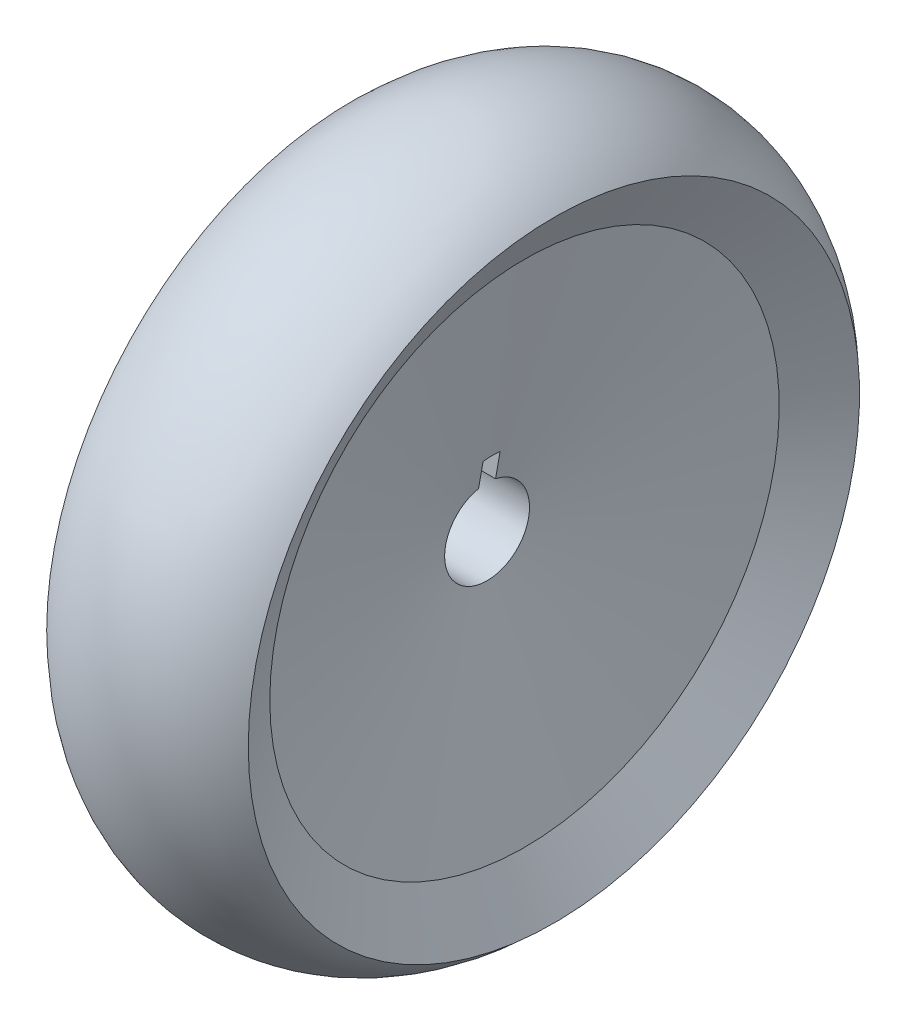
ISO-10303-21;
HEADER;
FILE_DESCRIPTION(('STEP AP214'),'2;1');
FILE_NAME('part.step','',(''),(''),'','','');
FILE_SCHEMA(('AUTOMOTIVE_DESIGN { 1 0 10303 214 1 1 1 1 }'));
ENDSEC;
DATA;
#1=APPLICATION_CONTEXT('core data for automotive mechanical design processes');
#2=APPLICATION_PROTOCOL_DEFINITION('international standard','automotive_design',2000,#1);
#3=PRODUCT_CONTEXT('',#1,'mechanical');
#4=PRODUCT('Part','Part','',(#3));
#5=PRODUCT_RELATED_PRODUCT_CATEGORY('part','',(#4));
#6=PRODUCT_DEFINITION_FORMATION('','',#4);
#7=PRODUCT_DEFINITION_CONTEXT('part definition',#1,'design');
#8=PRODUCT_DEFINITION('design','',#6,#7);
#9=PRODUCT_DEFINITION_SHAPE('','',#8);
#10=(LENGTH_UNIT() NAMED_UNIT(*) SI_UNIT(.MILLI.,.METRE.));
#11=(NAMED_UNIT(*) PLANE_ANGLE_UNIT() SI_UNIT($,.RADIAN.));
#12=(NAMED_UNIT(*) SI_UNIT($,.STERADIAN.) SOLID_ANGLE_UNIT());
#13=UNCERTAINTY_MEASURE_WITH_UNIT(LENGTH_MEASURE(1.E-05),#10,'distance_accuracy_value','');
#14=(GEOMETRIC_REPRESENTATION_CONTEXT(3) GLOBAL_UNCERTAINTY_ASSIGNED_CONTEXT((#13)) GLOBAL_UNIT_ASSIGNED_CONTEXT((#10,
#11,#12)) REPRESENTATION_CONTEXT('',''));
#15=CARTESIAN_POINT('',(0.,0.,0.));
#16=DIRECTION('',(0.,0.,1.));
#17=DIRECTION('',(1.,0.,0.));
#18=AXIS2_PLACEMENT_3D('',#15,#16,#17);
#19=CARTESIAN_POINT('',(-4.,-5.,0.));
#20=DIRECTION('',(-1.,0.,0.));
#21=DIRECTION('',(0.,0.,1.));
#22=AXIS2_PLACEMENT_3D('',#19,#20,#21);
#23=CONICAL_SURFACE('',#22,5.,1.39626340159547);
#24=CARTESIAN_POINT('',(-8.40817451771145,-5.,0.));
#25=DIRECTION('',(-1.,0.,0.));
#26=DIRECTION('',(0.,0.,1.));
#27=AXIS2_PLACEMENT_3D('',#24,#25,#26);
#28=CIRCLE('',#27,30.);
#29=CARTESIAN_POINT('',(-8.40817451771145,-5.,30.));
#30=VERTEX_POINT('',#29);
#31=EDGE_CURVE('E152',#30,#30,#28,.T.);
#32=ORIENTED_EDGE('',*,*,#31,.T.);
#33=EDGE_LOOP('',(#32));
#34=FACE_BOUND('',#33,.T.);
#35=CARTESIAN_POINT('',(-4.,-5.,0.));
#36=DIRECTION('',(-1.,0.,0.));
#37=DIRECTION('',(0.,0.,1.));
#38=AXIS2_PLACEMENT_3D('',#35,#36,#37);
#39=CIRCLE('',#38,5.);
#40=CARTESIAN_POINT('',(-4.,-0.101020514433644,-1.));
#41=VERTEX_POINT('',#40);
#42=CARTESIAN_POINT('',(-4.,-0.101020514433644,1.));
#43=VERTEX_POINT('',#42);
#44=EDGE_CURVE('E154',#41,#43,#39,.T.);
#45=ORIENTED_EDGE('',*,*,#44,.F.);
#46=CARTESIAN_POINT('',(-4.0949953397562,-10.4477242935022,-1.));
#47=CARTESIAN_POINT('',(-4.05549262134846,-10.2198927264661,-1.));
#48=CARTESIAN_POINT('',(-4.01605039956605,-9.99205052531851,-1.));
#49=CARTESIAN_POINT('',(-3.93738862989191,-9.53625049224192,-1.));
#50=CARTESIAN_POINT('',(-3.89816915955308,-9.30829264693555,-1.));
#51=CARTESIAN_POINT('',(-3.81969503027919,-8.85006473863882,-1.));
#52=CARTESIAN_POINT('',(-3.78044385088361,-8.6197940794029,-1.));
#53=CARTESIAN_POINT('',(-3.70254698632518,-8.15922829719906,-1.));
#54=CARTESIAN_POINT('',(-3.6639011049388,-7.92893320758948,-1.));
#55=CARTESIAN_POINT('',(-3.60705517080225,-7.58509564474396,-1.));
#56=CARTESIAN_POINT('',(-3.58843360292708,-7.47162297454859,-1.));
#57=CARTESIAN_POINT('',(-3.55158105169908,-7.2446130848785,-1.));
#58=CARTESIAN_POINT('',(-3.53335007164142,-7.13107586486749,-1.));
#59=CARTESIAN_POINT('',(-3.4974416155918,-6.90378843226859,-1.));
#60=CARTESIAN_POINT('',(-3.47976475554146,-6.79003812191261,-1.));
#61=CARTESIAN_POINT('',(-3.44529326218424,-6.56240607769539,-1.));
#62=CARTESIAN_POINT('',(-3.42849860560906,-6.44852434738143,-1.));
#63=CARTESIAN_POINT('',(-3.39642474798512,-6.2212364745564,-1.));
#64=CARTESIAN_POINT('',(-3.38113711178607,-6.10783154254076,-1.));
#65=CARTESIAN_POINT('',(-3.35289331608374,-5.88070060454994,-1.));
#66=CARTESIAN_POINT('',(-3.33993766113354,-5.76697453448577,-1.));
#67=CARTESIAN_POINT('',(-3.31801047059508,-5.5393883662773,-1.));
#68=CARTESIAN_POINT('',(-3.30902927712611,-5.42552927466088,-1.));
#69=CARTESIAN_POINT('',(-3.30006166975148,-5.25454592802465,-1.));
#70=CARTESIAN_POINT('',(-3.29782316053331,-5.19754102607922,-1.));
#71=CARTESIAN_POINT('',(-3.2950255113817,-5.08349113680168,-1.));
#72=CARTESIAN_POINT('',(-3.29446630186623,-5.02644615122841,-1.));
#73=CARTESIAN_POINT('',(-3.29514327930872,-4.90118551739926,-1.));
#74=CARTESIAN_POINT('',(-3.29675281827686,-4.83297170227786,-1.));
#75=CARTESIAN_POINT('',(-3.30225398682602,-4.69663564656761,-1.));
#76=CARTESIAN_POINT('',(-3.30614577363565,-4.62851341261208,-1.));
#77=CARTESIAN_POINT('',(-3.31580370670386,-4.49236320315965,-1.));
#78=CARTESIAN_POINT('',(-3.32157102050588,-4.42433531295327,-1.));
#79=CARTESIAN_POINT('',(-3.3345431452065,-4.28841988020657,-1.));
#80=CARTESIAN_POINT('',(-3.34174795366042,-4.22053233742776,-1.));
#81=CARTESIAN_POINT('',(-3.3649712437198,-4.01668410420584,-1.));
#82=CARTESIAN_POINT('',(-3.38256812838499,-3.8809057823982,-1.));
#83=CARTESIAN_POINT('',(-3.41997729053934,-3.60970705931952,-1.));
#84=CARTESIAN_POINT('',(-3.43978893095382,-3.47428656653344,-1.));
#85=CARTESIAN_POINT('',(-3.48083337594052,-3.20259582989226,-1.));
#86=CARTESIAN_POINT('',(-3.5020759425236,-3.06632706504129,-1.));
#87=CARTESIAN_POINT('',(-3.54533040343861,-2.79390520856375,-1.));
#88=CARTESIAN_POINT('',(-3.56734233955732,-2.65775212363277,-1.));
#89=CARTESIAN_POINT('',(-3.61182546436933,-2.38571681440719,-1.));
#90=CARTESIAN_POINT('',(-3.6342959670461,-2.2498344777507,-1.));
#91=CARTESIAN_POINT('',(-3.67956594382536,-1.97812690020922,-1.));
#92=CARTESIAN_POINT('',(-3.70236541285278,-1.84230165847661,-1.));
#93=CARTESIAN_POINT('',(-3.771889788315,-1.43021439585652,-1.));
#94=CARTESIAN_POINT('',(-3.81896863891703,-1.15401214905602,-1.));
#95=CARTESIAN_POINT('',(-3.91363491815097,-0.601589657599039,-1.));
#96=CARTESIAN_POINT('',(-3.96122252898133,-0.325369444280524,-1.));
#97=CARTESIAN_POINT('',(-4.0565420673931,0.226132587644694,-1.));
#98=CARTESIAN_POINT('',(-4.10427304077768,0.501414571197526,-1.));
#99=CARTESIAN_POINT('',(-4.19992007624104,1.05191792651678,-1.));
#100=CARTESIAN_POINT('',(-4.24783611928792,1.32713930159286,-1.));
#101=CARTESIAN_POINT('',(-4.39539265981559,2.17353241707474,-1.));
#102=CARTESIAN_POINT('',(-4.49524137968804,2.74466784767065,-1.));
#103=CARTESIAN_POINT('',(-4.69531355880471,3.88748730185818,-1.));
#104=CARTESIAN_POINT('',(-4.79553730037337,4.45917127596921,-1.));
#105=CARTESIAN_POINT('',(-4.99397898215918,5.59017291976848,-1.));
#106=CARTESIAN_POINT('',(-5.09219352660007,6.14949118529001,-1.));
#107=CARTESIAN_POINT('',(-5.28862234296608,7.26753382141367,-1.));
#108=CARTESIAN_POINT('',(-5.3868365109503,7.82625821027554,-1.));
#109=CARTESIAN_POINT('',(-5.48507547718713,8.38497822669593,-1.));
#110=B_SPLINE_CURVE_WITH_KNOTS('',3,(#46,#47,#48,#49,#50,#51,#52,#53,#54,#55,#56,#57,#58,#59,
#60,#61,#62,#63,#64,#65,#66,#67,#68,#69,#70,#71,#72,#73,#74,#75,#76,#77,#78,#79,#80,#81,#82,#83,
#84,#85,#86,#87,#88,#89,#90,#91,#92,#93,#94,#95,#96,#97,#98,#99,#100,#101,#102,#103,#104,#105,
#106,#107,#108,#109),.UNSPECIFIED.,.F.,.F.,(4,2,2,2,2,2,2,2,2,2,2,2,2,2,2,2,2,2,2,2,2,2,2,2,2,2,
2,2,2,2,2,4),(0.,0.693692655590847,1.38761360280219,2.08838937992136,2.78893307286555,
3.13390404678001,3.47887792987367,3.82422257641732,4.16955810985119,4.51283554631847,
4.85618716607386,5.19869980270709,5.36982432098763,5.54094174860091,5.74559578899456,
5.95026393007111,6.15505972478932,6.3598551712251,6.77055316686092,7.18113332769644,
7.59487263062117,8.00863443999859,8.42181704676638,8.83499328603165,9.67554970844477,
10.5164179701904,11.3545859372902,12.1926698906725,13.9320630106282,15.673271275019,
17.376898911375,19.0787715937897),.UNSPECIFIED.);
#111=CARTESIAN_POINT('',(-4.52898094212538,2.93725393319377,-1.));
#112=VERTEX_POINT('',#111);
#113=EDGE_CURVE('E64',#41,#112,#110,.T.);
#114=ORIENTED_EDGE('',*,*,#113,.T.);
#115=CARTESIAN_POINT('',(-4.52898094212537,-5.,0.));
#116=DIRECTION('',(-1.,0.,0.));
#117=DIRECTION('',(0.,0.,1.));
#118=AXIS2_PLACEMENT_3D('',#115,#116,#117);
#119=CIRCLE('',#118,8.);
#120=CARTESIAN_POINT('',(-4.52898094212537,2.93725393319377,1.));
#121=VERTEX_POINT('',#120);
#122=EDGE_CURVE('E88',#112,#121,#119,.F.);
#123=ORIENTED_EDGE('',*,*,#122,.T.);
#124=CARTESIAN_POINT('',(-4.0949953397562,-10.4477242935022,1.));
#125=CARTESIAN_POINT('',(-4.05549262134846,-10.2198927264661,1.));
#126=CARTESIAN_POINT('',(-4.01605039956605,-9.99205052531851,1.));
#127=CARTESIAN_POINT('',(-3.93738862989191,-9.53625049224192,1.));
#128=CARTESIAN_POINT('',(-3.89816915955308,-9.30829264693555,1.));
#129=CARTESIAN_POINT('',(-3.81969503027919,-8.85006473863882,1.));
#130=CARTESIAN_POINT('',(-3.78044385088361,-8.6197940794029,1.));
#131=CARTESIAN_POINT('',(-3.70254698632518,-8.15922829719906,1.));
#132=CARTESIAN_POINT('',(-3.6639011049388,-7.92893320758948,1.));
#133=CARTESIAN_POINT('',(-3.60705517080225,-7.58509564474396,1.));
#134=CARTESIAN_POINT('',(-3.58843360292708,-7.4716229745486,1.));
#135=CARTESIAN_POINT('',(-3.55158105169908,-7.2446130848785,1.));
#136=CARTESIAN_POINT('',(-3.53335007164142,-7.13107586486749,1.));
#137=CARTESIAN_POINT('',(-3.4974416155918,-6.90378843226859,1.));
#138=CARTESIAN_POINT('',(-3.47976475554146,-6.79003812191261,1.));
#139=CARTESIAN_POINT('',(-3.44529326218424,-6.5624060776954,1.));
#140=CARTESIAN_POINT('',(-3.42849860560906,-6.44852434738143,1.));
#141=CARTESIAN_POINT('',(-3.39642474798512,-6.2212364745564,1.));
#142=CARTESIAN_POINT('',(-3.38113711178607,-6.10783154254076,1.));
#143=CARTESIAN_POINT('',(-3.35289331608374,-5.88070060454994,1.));
#144=CARTESIAN_POINT('',(-3.33993766113354,-5.76697453448577,1.));
#145=CARTESIAN_POINT('',(-3.31801047059508,-5.5393883662773,1.));
#146=CARTESIAN_POINT('',(-3.30902927712611,-5.42552927466088,1.));
#147=CARTESIAN_POINT('',(-3.30006166975148,-5.25454592802464,1.));
#148=CARTESIAN_POINT('',(-3.29782316053331,-5.19754102607922,1.));
#149=CARTESIAN_POINT('',(-3.2950255113817,-5.08349113680168,1.));
#150=CARTESIAN_POINT('',(-3.29446630186623,-5.02644615122841,1.));
#151=CARTESIAN_POINT('',(-3.29514327930872,-4.90118551739926,1.));
#152=CARTESIAN_POINT('',(-3.29675281827686,-4.83297170227786,1.));
#153=CARTESIAN_POINT('',(-3.30225398682602,-4.69663564656761,1.));
#154=CARTESIAN_POINT('',(-3.30614577363565,-4.62851341261208,1.));
#155=CARTESIAN_POINT('',(-3.31580370670386,-4.49236320315965,1.));
#156=CARTESIAN_POINT('',(-3.32157102050588,-4.42433531295327,1.));
#157=CARTESIAN_POINT('',(-3.3345431452065,-4.28841988020657,1.));
#158=CARTESIAN_POINT('',(-3.34174795366042,-4.22053233742776,1.));
#159=CARTESIAN_POINT('',(-3.3649712437198,-4.01668410420584,1.));
#160=CARTESIAN_POINT('',(-3.38256812838499,-3.8809057823982,1.));
#161=CARTESIAN_POINT('',(-3.41997729053934,-3.60970705931952,1.));
#162=CARTESIAN_POINT('',(-3.43978893095382,-3.47428656653344,1.));
#163=CARTESIAN_POINT('',(-3.48083337594052,-3.20259582989226,1.));
#164=CARTESIAN_POINT('',(-3.5020759425236,-3.06632706504129,1.));
#165=CARTESIAN_POINT('',(-3.54533040343861,-2.79390520856375,1.));
#166=CARTESIAN_POINT('',(-3.56734233955732,-2.65775212363277,1.));
#167=CARTESIAN_POINT('',(-3.61182546436933,-2.38571681440719,1.));
#168=CARTESIAN_POINT('',(-3.6342959670461,-2.2498344777507,1.));
#169=CARTESIAN_POINT('',(-3.67956594382536,-1.97812690020922,1.));
#170=CARTESIAN_POINT('',(-3.70236541285278,-1.84230165847661,1.));
#171=CARTESIAN_POINT('',(-3.771889788315,-1.43021439585652,1.));
#172=CARTESIAN_POINT('',(-3.81896863891703,-1.15401214905602,1.));
#173=CARTESIAN_POINT('',(-3.91363491815097,-0.60158965759904,1.));
#174=CARTESIAN_POINT('',(-3.96122252898133,-0.325369444280525,1.));
#175=CARTESIAN_POINT('',(-4.0565420673931,0.226132587644692,1.));
#176=CARTESIAN_POINT('',(-4.10427304077768,0.501414571197524,1.));
#177=CARTESIAN_POINT('',(-4.19992007624104,1.05191792651678,1.));
#178=CARTESIAN_POINT('',(-4.24783611928792,1.32713930159285,1.));
#179=CARTESIAN_POINT('',(-4.39539265981559,2.17353241707474,1.));
#180=CARTESIAN_POINT('',(-4.49524137968804,2.74466784767065,1.));
#181=CARTESIAN_POINT('',(-4.69531355880471,3.88748730185818,1.));
#182=CARTESIAN_POINT('',(-4.79553730037337,4.45917127596921,1.));
#183=CARTESIAN_POINT('',(-4.99397898215918,5.59017291976848,1.));
#184=CARTESIAN_POINT('',(-5.09219352660007,6.14949118529001,1.));
#185=CARTESIAN_POINT('',(-5.28862234296608,7.26753382141367,1.));
#186=CARTESIAN_POINT('',(-5.3868365109503,7.82625821027554,1.));
#187=CARTESIAN_POINT('',(-5.48507547718713,8.38497822669593,1.));
#188=B_SPLINE_CURVE_WITH_KNOTS('',3,(#124,#125,#126,#127,#128,#129,#130,#131,#132,#133,#134,
#135,#136,#137,#138,#139,#140,#141,#142,#143,#144,#145,#146,#147,#148,#149,#150,#151,#152,#153,
#154,#155,#156,#157,#158,#159,#160,#161,#162,#163,#164,#165,#166,#167,#168,#169,#170,#171,#172,
#173,#174,#175,#176,#177,#178,#179,#180,#181,#182,#183,#184,#185,#186,#187),.UNSPECIFIED.,.F.,
.F.,(4,2,2,2,2,2,2,2,2,2,2,2,2,2,2,2,2,2,2,2,2,2,2,2,2,2,2,2,2,2,2,4),(0.,0.693692655590847,
1.38761360280219,2.08838937992136,2.78893307286555,3.13390404678001,3.47887792987366,
3.82422257641732,4.16955810985119,4.51283554631847,4.85618716607386,5.19869980270709,
5.36982432098763,5.54094174860091,5.74559578899456,5.95026393007111,6.15505972478932,
6.3598551712251,6.77055316686092,7.18113332769644,7.59487263062117,8.00863443999859,
8.42181704676637,8.83499328603165,9.67554970844477,10.5164179701904,11.3545859372902,
12.1926698906725,13.9320630106282,15.673271275019,17.376898911375,19.0787715937897),.UNSPECIFIED.);
#189=EDGE_CURVE('E80',#43,#121,#188,.T.);
#190=ORIENTED_EDGE('',*,*,#189,.F.);
#191=EDGE_LOOP('',(#45,#114,#123,#190));
#192=FACE_BOUND('',#191,.T.);
#193=ADVANCED_FACE('F36',(#34,#192),#23,.F.);
#194=CARTESIAN_POINT('',(-4.,-5.,0.));
#195=DIRECTION('',(-1.,0.,0.));
#196=DIRECTION('',(0.,0.,1.));
#197=AXIS2_PLACEMENT_3D('',#194,#195,#196);
#198=CYLINDRICAL_SURFACE('',#197,5.);
#199=CARTESIAN_POINT('',(4.,-5.,0.));
#200=DIRECTION('',(-1.,0.,0.));
#201=DIRECTION('',(0.,0.,1.));
#202=AXIS2_PLACEMENT_3D('',#199,#200,#201);
#203=CIRCLE('',#202,5.);
#204=CARTESIAN_POINT('',(3.99999999999999,-0.101020514433639,-1.));
#205=VERTEX_POINT('',#204);
#206=CARTESIAN_POINT('',(3.99999999999999,-0.10102051443364,1.));
#207=VERTEX_POINT('',#206);
#208=EDGE_CURVE('E156',#205,#207,#203,.T.);
#209=ORIENTED_EDGE('',*,*,#208,.F.);
#210=DIRECTION('',(-1.,0.,0.));
#211=VECTOR('',#210,1.);
#212=CARTESIAN_POINT('',(-4.,-0.101020514433644,-1.));
#213=LINE('',#212,#211);
#214=EDGE_CURVE('E97',#205,#41,#213,.T.);
#215=ORIENTED_EDGE('',*,*,#214,.T.);
#216=ORIENTED_EDGE('',*,*,#44,.T.);
#217=DIRECTION('',(-1.,0.,0.));
#218=VECTOR('',#217,1.);
#219=CARTESIAN_POINT('',(-4.,-0.101020514433644,1.));
#220=LINE('',#219,#218);
#221=EDGE_CURVE('E83',#207,#43,#220,.T.);
#222=ORIENTED_EDGE('',*,*,#221,.F.);
#223=EDGE_LOOP('',(#209,#215,#216,#222));
#224=FACE_BOUND('',#223,.T.);
#225=ADVANCED_FACE('F128',(#224),#198,.F.);
#226=CARTESIAN_POINT('',(4.,-5.,0.));
#227=DIRECTION('',(1.,0.,0.));
#228=DIRECTION('',(0.,0.,-1.));
#229=AXIS2_PLACEMENT_3D('',#226,#227,#228);
#230=CONICAL_SURFACE('',#229,5.,1.39626340159547);
#231=CARTESIAN_POINT('',(8.40817451771145,-5.,0.));
#232=DIRECTION('',(-1.,0.,0.));
#233=DIRECTION('',(0.,0.,1.));
#234=AXIS2_PLACEMENT_3D('',#231,#232,#233);
#235=CIRCLE('',#234,30.);
#236=CARTESIAN_POINT('',(8.40817451771145,-5.,30.));
#237=VERTEX_POINT('',#236);
#238=EDGE_CURVE('E160',#237,#237,#235,.T.);
#239=ORIENTED_EDGE('',*,*,#238,.F.);
#240=EDGE_LOOP('',(#239));
#241=FACE_BOUND('',#240,.T.);
#242=CARTESIAN_POINT('',(4.0949953397562,-10.4477242935022,-1.));
#243=CARTESIAN_POINT('',(4.05549262134846,-10.2198927264661,-1.));
#244=CARTESIAN_POINT('',(4.01605039956605,-9.99205052531851,-1.));
#245=CARTESIAN_POINT('',(3.93738862989191,-9.53625049224192,-1.));
#246=CARTESIAN_POINT('',(3.89816915955308,-9.30829264693555,-1.));
#247=CARTESIAN_POINT('',(3.81969503027919,-8.85006473863882,-1.));
#248=CARTESIAN_POINT('',(3.78044385088361,-8.6197940794029,-1.));
#249=CARTESIAN_POINT('',(3.70254698632518,-8.15922829719906,-1.));
#250=CARTESIAN_POINT('',(3.6639011049388,-7.92893320758948,-1.));
#251=CARTESIAN_POINT('',(3.60705517080225,-7.58509564474396,-1.));
#252=CARTESIAN_POINT('',(3.58843360292708,-7.47162297454859,-1.));
#253=CARTESIAN_POINT('',(3.55158105169908,-7.2446130848785,-1.));
#254=CARTESIAN_POINT('',(3.53335007164142,-7.13107586486749,-1.));
#255=CARTESIAN_POINT('',(3.4974416155918,-6.90378843226859,-1.));
#256=CARTESIAN_POINT('',(3.47976475554146,-6.79003812191261,-1.));
#257=CARTESIAN_POINT('',(3.44529326218424,-6.56240607769539,-1.));
#258=CARTESIAN_POINT('',(3.42849860560906,-6.44852434738143,-1.));
#259=CARTESIAN_POINT('',(3.39642474798512,-6.2212364745564,-1.));
#260=CARTESIAN_POINT('',(3.38113711178607,-6.10783154254076,-1.));
#261=CARTESIAN_POINT('',(3.35289331608374,-5.88070060454994,-1.));
#262=CARTESIAN_POINT('',(3.33993766113354,-5.76697453448577,-1.));
#263=CARTESIAN_POINT('',(3.31801047059508,-5.5393883662773,-1.));
#264=CARTESIAN_POINT('',(3.30902927712611,-5.42552927466088,-1.));
#265=CARTESIAN_POINT('',(3.30006166975148,-5.25454592802465,-1.));
#266=CARTESIAN_POINT('',(3.29782316053331,-5.19754102607922,-1.));
#267=CARTESIAN_POINT('',(3.2950255113817,-5.08349113680168,-1.));
#268=CARTESIAN_POINT('',(3.29446630186623,-5.02644615122841,-1.));
#269=CARTESIAN_POINT('',(3.29514327930872,-4.90118551739926,-1.));
#270=CARTESIAN_POINT('',(3.29675281827686,-4.83297170227786,-1.));
#271=CARTESIAN_POINT('',(3.30225398682602,-4.69663564656761,-1.));
#272=CARTESIAN_POINT('',(3.30614577363565,-4.62851341261208,-1.));
#273=CARTESIAN_POINT('',(3.31580370670386,-4.49236320315965,-1.));
#274=CARTESIAN_POINT('',(3.32157102050588,-4.42433531295327,-1.));
#275=CARTESIAN_POINT('',(3.3345431452065,-4.28841988020657,-1.));
#276=CARTESIAN_POINT('',(3.34174795366042,-4.22053233742776,-1.));
#277=CARTESIAN_POINT('',(3.3649712437198,-4.01668410420584,-1.));
#278=CARTESIAN_POINT('',(3.38256812838499,-3.8809057823982,-1.));
#279=CARTESIAN_POINT('',(3.41997729053934,-3.60970705931952,-1.));
#280=CARTESIAN_POINT('',(3.43978893095382,-3.47428656653344,-1.));
#281=CARTESIAN_POINT('',(3.48083337594052,-3.20259582989226,-1.));
#282=CARTESIAN_POINT('',(3.5020759425236,-3.06632706504129,-1.));
#283=CARTESIAN_POINT('',(3.54533040343861,-2.79390520856375,-1.));
#284=CARTESIAN_POINT('',(3.56734233955732,-2.65775212363277,-1.));
#285=CARTESIAN_POINT('',(3.61182546436933,-2.38571681440719,-1.));
#286=CARTESIAN_POINT('',(3.6342959670461,-2.2498344777507,-1.));
#287=CARTESIAN_POINT('',(3.67956594382536,-1.97812690020922,-1.));
#288=CARTESIAN_POINT('',(3.70236541285278,-1.84230165847661,-1.));
#289=CARTESIAN_POINT('',(3.771889788315,-1.43021439585652,-1.));
#290=CARTESIAN_POINT('',(3.81896863891703,-1.15401214905602,-1.));
#291=CARTESIAN_POINT('',(3.91363491815097,-0.601589657599039,-1.));
#292=CARTESIAN_POINT('',(3.96122252898133,-0.325369444280524,-1.));
#293=CARTESIAN_POINT('',(4.0565420673931,0.226132587644694,-1.));
#294=CARTESIAN_POINT('',(4.10427304077768,0.501414571197526,-1.));
#295=CARTESIAN_POINT('',(4.19992007624104,1.05191792651678,-1.));
#296=CARTESIAN_POINT('',(4.24783611928792,1.32713930159286,-1.));
#297=CARTESIAN_POINT('',(4.39539265981559,2.17353241707474,-1.));
#298=CARTESIAN_POINT('',(4.49524137968804,2.74466784767065,-1.));
#299=CARTESIAN_POINT('',(4.69531355880471,3.88748730185818,-1.));
#300=CARTESIAN_POINT('',(4.79553730037337,4.45917127596921,-1.));
#301=CARTESIAN_POINT('',(4.99397898215918,5.59017291976848,-1.));
#302=CARTESIAN_POINT('',(5.09219352660007,6.14949118529001,-1.));
#303=CARTESIAN_POINT('',(5.28862234296608,7.26753382141367,-1.));
#304=CARTESIAN_POINT('',(5.3868365109503,7.82625821027554,-1.));
#305=CARTESIAN_POINT('',(5.48507547718713,8.38497822669593,-1.));
#306=B_SPLINE_CURVE_WITH_KNOTS('',3,(#242,#243,#244,#245,#246,#247,#248,#249,#250,#251,#252,
#253,#254,#255,#256,#257,#258,#259,#260,#261,#262,#263,#264,#265,#266,#267,#268,#269,#270,#271,
#272,#273,#274,#275,#276,#277,#278,#279,#280,#281,#282,#283,#284,#285,#286,#287,#288,#289,#290,
#291,#292,#293,#294,#295,#296,#297,#298,#299,#300,#301,#302,#303,#304,#305),.UNSPECIFIED.,.F.,
.F.,(4,2,2,2,2,2,2,2,2,2,2,2,2,2,2,2,2,2,2,2,2,2,2,2,2,2,2,2,2,2,2,4),(0.,0.693692655590847,
1.38761360280219,2.08838937992136,2.78893307286555,3.13390404678001,3.47887792987367,
3.82422257641732,4.16955810985119,4.51283554631847,4.85618716607386,5.19869980270709,
5.36982432098763,5.54094174860091,5.74559578899456,5.95026393007111,6.15505972478932,
6.3598551712251,6.77055316686092,7.18113332769644,7.59487263062117,8.00863443999859,
8.42181704676638,8.83499328603165,9.67554970844477,10.5164179701904,11.3545859372902,
12.1926698906725,13.9320630106282,15.673271275019,17.376898911375,19.0787715937897),.UNSPECIFIED.);
#307=CARTESIAN_POINT('',(4.52898094212537,2.93725393319377,-1.));
#308=VERTEX_POINT('',#307);
#309=EDGE_CURVE('E11',#205,#308,#306,.T.);
#310=ORIENTED_EDGE('',*,*,#309,.F.);
#311=ORIENTED_EDGE('',*,*,#208,.T.);
#312=CARTESIAN_POINT('',(4.0949953397562,-10.4477242935022,1.));
#313=CARTESIAN_POINT('',(4.05549262134846,-10.2198927264661,1.));
#314=CARTESIAN_POINT('',(4.01605039956605,-9.99205052531851,1.));
#315=CARTESIAN_POINT('',(3.93738862989191,-9.53625049224192,1.));
#316=CARTESIAN_POINT('',(3.89816915955308,-9.30829264693555,1.));
#317=CARTESIAN_POINT('',(3.81969503027919,-8.85006473863882,1.));
#318=CARTESIAN_POINT('',(3.78044385088361,-8.6197940794029,1.));
#319=CARTESIAN_POINT('',(3.70254698632518,-8.15922829719906,1.));
#320=CARTESIAN_POINT('',(3.6639011049388,-7.92893320758948,1.));
#321=CARTESIAN_POINT('',(3.60705517080225,-7.58509564474396,1.));
#322=CARTESIAN_POINT('',(3.58843360292708,-7.4716229745486,1.));
#323=CARTESIAN_POINT('',(3.55158105169908,-7.2446130848785,1.));
#324=CARTESIAN_POINT('',(3.53335007164142,-7.13107586486749,1.));
#325=CARTESIAN_POINT('',(3.4974416155918,-6.90378843226859,1.));
#326=CARTESIAN_POINT('',(3.47976475554146,-6.79003812191261,1.));
#327=CARTESIAN_POINT('',(3.44529326218424,-6.5624060776954,1.));
#328=CARTESIAN_POINT('',(3.42849860560906,-6.44852434738143,1.));
#329=CARTESIAN_POINT('',(3.39642474798512,-6.2212364745564,1.));
#330=CARTESIAN_POINT('',(3.38113711178607,-6.10783154254076,1.));
#331=CARTESIAN_POINT('',(3.35289331608374,-5.88070060454994,1.));
#332=CARTESIAN_POINT('',(3.33993766113354,-5.76697453448577,1.));
#333=CARTESIAN_POINT('',(3.31801047059508,-5.5393883662773,1.));
#334=CARTESIAN_POINT('',(3.30902927712611,-5.42552927466088,1.));
#335=CARTESIAN_POINT('',(3.30006166975148,-5.25454592802464,1.));
#336=CARTESIAN_POINT('',(3.29782316053331,-5.19754102607922,1.));
#337=CARTESIAN_POINT('',(3.2950255113817,-5.08349113680168,1.));
#338=CARTESIAN_POINT('',(3.29446630186623,-5.02644615122841,1.));
#339=CARTESIAN_POINT('',(3.29514327930872,-4.90118551739926,1.));
#340=CARTESIAN_POINT('',(3.29675281827686,-4.83297170227786,1.));
#341=CARTESIAN_POINT('',(3.30225398682602,-4.69663564656761,1.));
#342=CARTESIAN_POINT('',(3.30614577363565,-4.62851341261208,1.));
#343=CARTESIAN_POINT('',(3.31580370670386,-4.49236320315965,1.));
#344=CARTESIAN_POINT('',(3.32157102050588,-4.42433531295327,1.));
#345=CARTESIAN_POINT('',(3.3345431452065,-4.28841988020657,1.));
#346=CARTESIAN_POINT('',(3.34174795366042,-4.22053233742776,1.));
#347=CARTESIAN_POINT('',(3.3649712437198,-4.01668410420584,1.));
#348=CARTESIAN_POINT('',(3.38256812838499,-3.8809057823982,1.));
#349=CARTESIAN_POINT('',(3.41997729053934,-3.60970705931952,1.));
#350=CARTESIAN_POINT('',(3.43978893095382,-3.47428656653344,1.));
#351=CARTESIAN_POINT('',(3.48083337594052,-3.20259582989226,1.));
#352=CARTESIAN_POINT('',(3.5020759425236,-3.06632706504129,1.));
#353=CARTESIAN_POINT('',(3.54533040343861,-2.79390520856375,1.));
#354=CARTESIAN_POINT('',(3.56734233955732,-2.65775212363277,1.));
#355=CARTESIAN_POINT('',(3.61182546436933,-2.38571681440719,1.));
#356=CARTESIAN_POINT('',(3.6342959670461,-2.2498344777507,1.));
#357=CARTESIAN_POINT('',(3.67956594382536,-1.97812690020922,1.));
#358=CARTESIAN_POINT('',(3.70236541285278,-1.84230165847661,1.));
#359=CARTESIAN_POINT('',(3.771889788315,-1.43021439585652,1.));
#360=CARTESIAN_POINT('',(3.81896863891703,-1.15401214905602,1.));
#361=CARTESIAN_POINT('',(3.91363491815097,-0.60158965759904,1.));
#362=CARTESIAN_POINT('',(3.96122252898133,-0.325369444280525,1.));
#363=CARTESIAN_POINT('',(4.0565420673931,0.226132587644692,1.));
#364=CARTESIAN_POINT('',(4.10427304077768,0.501414571197524,1.));
#365=CARTESIAN_POINT('',(4.19992007624104,1.05191792651678,1.));
#366=CARTESIAN_POINT('',(4.24783611928792,1.32713930159285,1.));
#367=CARTESIAN_POINT('',(4.39539265981559,2.17353241707474,1.));
#368=CARTESIAN_POINT('',(4.49524137968804,2.74466784767065,1.));
#369=CARTESIAN_POINT('',(4.69531355880471,3.88748730185818,1.));
#370=CARTESIAN_POINT('',(4.79553730037337,4.45917127596921,1.));
#371=CARTESIAN_POINT('',(4.99397898215918,5.59017291976848,1.));
#372=CARTESIAN_POINT('',(5.09219352660007,6.14949118529001,1.));
#373=CARTESIAN_POINT('',(5.28862234296608,7.26753382141367,1.));
#374=CARTESIAN_POINT('',(5.3868365109503,7.82625821027554,1.));
#375=CARTESIAN_POINT('',(5.48507547718713,8.38497822669593,1.));
#376=B_SPLINE_CURVE_WITH_KNOTS('',3,(#312,#313,#314,#315,#316,#317,#318,#319,#320,#321,#322,
#323,#324,#325,#326,#327,#328,#329,#330,#331,#332,#333,#334,#335,#336,#337,#338,#339,#340,#341,
#342,#343,#344,#345,#346,#347,#348,#349,#350,#351,#352,#353,#354,#355,#356,#357,#358,#359,#360,
#361,#362,#363,#364,#365,#366,#367,#368,#369,#370,#371,#372,#373,#374,#375),.UNSPECIFIED.,.F.,
.F.,(4,2,2,2,2,2,2,2,2,2,2,2,2,2,2,2,2,2,2,2,2,2,2,2,2,2,2,2,2,2,2,4),(0.,0.693692655590847,
1.38761360280219,2.08838937992136,2.78893307286555,3.13390404678001,3.47887792987366,
3.82422257641732,4.16955810985119,4.51283554631847,4.85618716607386,5.19869980270709,
5.36982432098763,5.54094174860091,5.74559578899456,5.95026393007111,6.15505972478932,
6.3598551712251,6.77055316686092,7.18113332769644,7.59487263062117,8.00863443999859,
8.42181704676637,8.83499328603165,9.67554970844477,10.5164179701904,11.3545859372902,
12.1926698906725,13.9320630106282,15.673271275019,17.376898911375,19.0787715937897),.UNSPECIFIED.);
#377=CARTESIAN_POINT('',(4.52898094212537,2.93725393319377,1.));
#378=VERTEX_POINT('',#377);
#379=EDGE_CURVE('E132',#207,#378,#376,.T.);
#380=ORIENTED_EDGE('',*,*,#379,.T.);
#381=CARTESIAN_POINT('',(4.52898094212537,-5.,0.));
#382=DIRECTION('',(1.,0.,0.));
#383=DIRECTION('',(0.,0.,-1.));
#384=AXIS2_PLACEMENT_3D('',#381,#382,#383);
#385=CIRCLE('',#384,8.);
#386=EDGE_CURVE('E49',#308,#378,#385,.T.);
#387=ORIENTED_EDGE('',*,*,#386,.F.);
#388=EDGE_LOOP('',(#310,#311,#380,#387));
#389=FACE_BOUND('',#388,.T.);
#390=ADVANCED_FACE('F125',(#241,#389),#230,.F.);
#391=CARTESIAN_POINT('',(-4.13486794946158E-13,-5.,0.));
#392=DIRECTION('',(-1.,0.,0.));
#393=DIRECTION('',(0.,0.,1.));
#394=AXIS2_PLACEMENT_3D('',#391,#392,#393);
#395=TOROIDAL_SURFACE('',#394,24.1752258064512,16.7563786452514);
#396=CARTESIAN_POINT('',(11.8722761328492,-5.,0.));
#397=DIRECTION('',(-1.,0.,0.));
#398=DIRECTION('',(0.,0.,1.));
#399=AXIS2_PLACEMENT_3D('',#396,#397,#398);
#400=CIRCLE('',#399,36.);
#401=CARTESIAN_POINT('',(11.8722761328492,-5.,36.));
#402=VERTEX_POINT('',#401);
#403=EDGE_CURVE('E111',#402,#402,#400,.T.);
#404=ORIENTED_EDGE('',*,*,#403,.T.);
#405=EDGE_LOOP('',(#404));
#406=FACE_BOUND('',#405,.T.);
#407=CARTESIAN_POINT('',(-11.8722761328492,-5.,0.));
#408=DIRECTION('',(-1.,0.,0.));
#409=DIRECTION('',(0.,0.,1.));
#410=AXIS2_PLACEMENT_3D('',#407,#408,#409);
#411=CIRCLE('',#410,36.);
#412=CARTESIAN_POINT('',(-11.8722761328492,-5.,36.));
#413=VERTEX_POINT('',#412);
#414=EDGE_CURVE('E137',#413,#413,#411,.T.);
#415=ORIENTED_EDGE('',*,*,#414,.F.);
#416=EDGE_LOOP('',(#415));
#417=FACE_BOUND('',#416,.T.);
#418=ADVANCED_FACE('F38',(#406,#417),#395,.T.);
#419=CARTESIAN_POINT('',(-8.40817451771145,-5.,0.));
#420=DIRECTION('',(-1.,0.,0.));
#421=DIRECTION('',(0.,0.,1.));
#422=AXIS2_PLACEMENT_3D('',#419,#420,#421);
#423=CONICAL_SURFACE('',#422,30.,1.0471975511966);
#424=ORIENTED_EDGE('',*,*,#414,.T.);
#425=EDGE_LOOP('',(#424));
#426=FACE_BOUND('',#425,.T.);
#427=ORIENTED_EDGE('',*,*,#31,.F.);
#428=EDGE_LOOP('',(#427));
#429=FACE_BOUND('',#428,.T.);
#430=ADVANCED_FACE('F123',(#426,#429),#423,.F.);
#431=CARTESIAN_POINT('',(8.40817451771145,-5.,0.));
#432=DIRECTION('',(1.,0.,0.));
#433=DIRECTION('',(0.,0.,-1.));
#434=AXIS2_PLACEMENT_3D('',#431,#432,#433);
#435=CONICAL_SURFACE('',#434,30.,1.0471975511966);
#436=ORIENTED_EDGE('',*,*,#403,.F.);
#437=EDGE_LOOP('',(#436));
#438=FACE_BOUND('',#437,.T.);
#439=ORIENTED_EDGE('',*,*,#238,.T.);
#440=EDGE_LOOP('',(#439));
#441=FACE_BOUND('',#440,.T.);
#442=ADVANCED_FACE('F120',(#438,#441),#435,.F.);
#443=CARTESIAN_POINT('',(20.,-5.,0.));
#444=DIRECTION('',(-1.,0.,0.));
#445=DIRECTION('',(0.,0.,1.));
#446=AXIS2_PLACEMENT_3D('',#443,#444,#445);
#447=CYLINDRICAL_SURFACE('',#446,8.);
#448=DIRECTION('',(-1.,0.,0.));
#449=VECTOR('',#448,1.);
#450=CARTESIAN_POINT('',(20.,2.93725393319377,-1.));
#451=LINE('',#450,#449);
#452=EDGE_CURVE('E95',#308,#112,#451,.T.);
#453=ORIENTED_EDGE('',*,*,#452,.F.);
#454=ORIENTED_EDGE('',*,*,#386,.T.);
#455=DIRECTION('',(-1.,0.,0.));
#456=VECTOR('',#455,1.);
#457=CARTESIAN_POINT('',(20.,2.93725393319377,1.));
#458=LINE('',#457,#456);
#459=EDGE_CURVE('E56',#378,#121,#458,.T.);
#460=ORIENTED_EDGE('',*,*,#459,.T.);
#461=ORIENTED_EDGE('',*,*,#122,.F.);
#462=EDGE_LOOP('',(#453,#454,#460,#461));
#463=FACE_BOUND('',#462,.T.);
#464=ADVANCED_FACE('F92',(#463),#447,.F.);
#465=CARTESIAN_POINT('',(20.,0.,-1.));
#466=DIRECTION('',(0.,0.,1.));
#467=DIRECTION('',(1.,0.,0.));
#468=AXIS2_PLACEMENT_3D('',#465,#466,#467);
#469=PLANE('',#468);
#470=ORIENTED_EDGE('',*,*,#214,.F.);
#471=ORIENTED_EDGE('',*,*,#309,.T.);
#472=ORIENTED_EDGE('',*,*,#452,.T.);
#473=ORIENTED_EDGE('',*,*,#113,.F.);
#474=EDGE_LOOP('',(#470,#471,#472,#473));
#475=FACE_BOUND('',#474,.T.);
#476=ADVANCED_FACE('F115',(#475),#469,.T.);
#477=CARTESIAN_POINT('',(20.,0.,1.));
#478=DIRECTION('',(0.,0.,1.));
#479=DIRECTION('',(1.,0.,0.));
#480=AXIS2_PLACEMENT_3D('',#477,#478,#479);
#481=PLANE('',#480);
#482=ORIENTED_EDGE('',*,*,#189,.T.);
#483=ORIENTED_EDGE('',*,*,#459,.F.);
#484=ORIENTED_EDGE('',*,*,#379,.F.);
#485=ORIENTED_EDGE('',*,*,#221,.T.);
#486=EDGE_LOOP('',(#482,#483,#484,#485));
#487=FACE_BOUND('',#486,.T.);
#488=ADVANCED_FACE('F81',(#487),#481,.F.);
#489=CLOSED_SHELL('',(#193,#225,#390,#418,#430,#442,#464,#476,#488));
#490=MANIFOLD_SOLID_BREP('B2',#489);
#491=ADVANCED_BREP_SHAPE_REPRESENTATION('',(#18,#490),#14);
#492=SHAPE_DEFINITION_REPRESENTATION(#9,#491);
ENDSEC;
END-ISO-10303-21;
